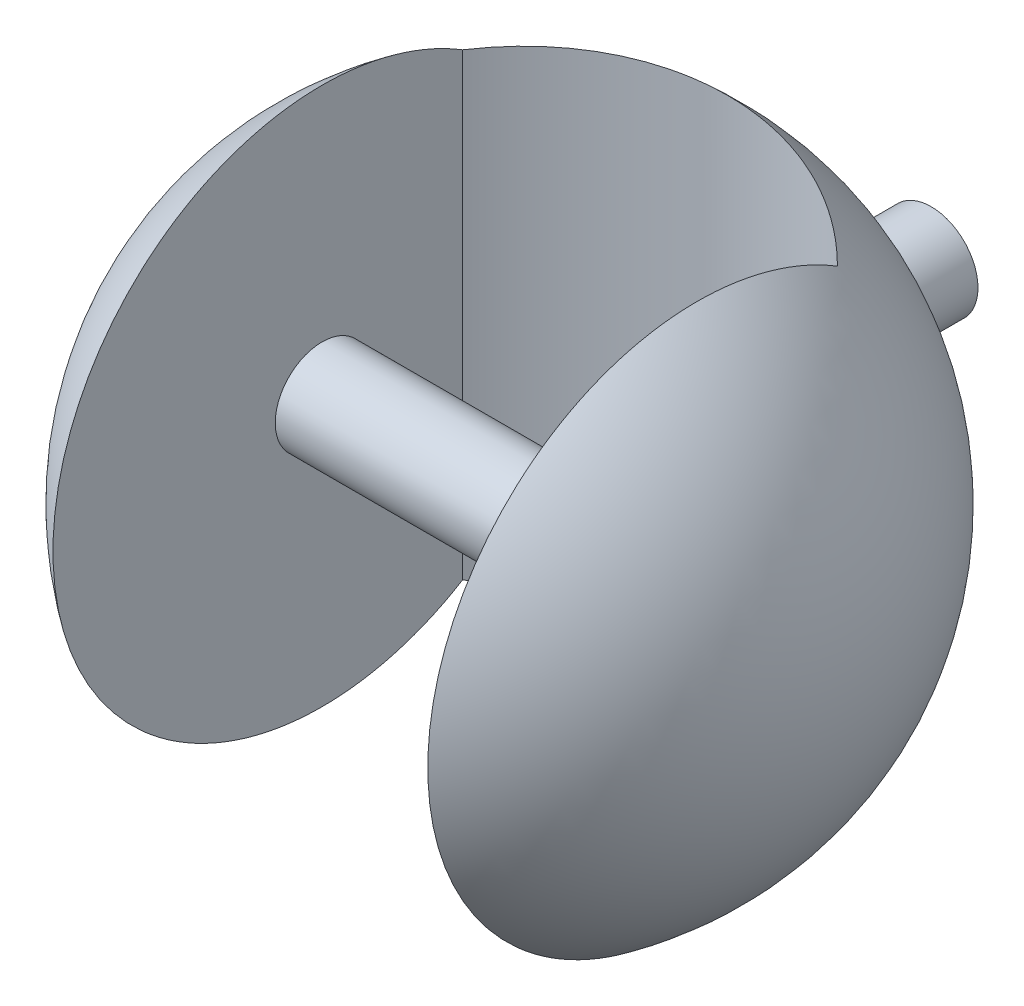
ISO-10303-21;
HEADER;
FILE_DESCRIPTION(('STEP AP214'),'2;1');
FILE_NAME('part.step','',(''),(''),'','','');
FILE_SCHEMA(('AUTOMOTIVE_DESIGN { 1 0 10303 214 1 1 1 1 }'));
ENDSEC;
DATA;
#1=APPLICATION_CONTEXT('core data for automotive mechanical design processes');
#2=APPLICATION_PROTOCOL_DEFINITION('international standard','automotive_design',2000,#1);
#3=PRODUCT_CONTEXT('',#1,'mechanical');
#4=PRODUCT('Part','Part','',(#3));
#5=PRODUCT_RELATED_PRODUCT_CATEGORY('part','',(#4));
#6=PRODUCT_DEFINITION_FORMATION('','',#4);
#7=PRODUCT_DEFINITION_CONTEXT('part definition',#1,'design');
#8=PRODUCT_DEFINITION('design','',#6,#7);
#9=PRODUCT_DEFINITION_SHAPE('','',#8);
#10=(LENGTH_UNIT() NAMED_UNIT(*) SI_UNIT(.MILLI.,.METRE.));
#11=(NAMED_UNIT(*) PLANE_ANGLE_UNIT() SI_UNIT($,.RADIAN.));
#12=(NAMED_UNIT(*) SI_UNIT($,.STERADIAN.) SOLID_ANGLE_UNIT());
#13=UNCERTAINTY_MEASURE_WITH_UNIT(LENGTH_MEASURE(1.E-05),#10,'distance_accuracy_value','');
#14=(GEOMETRIC_REPRESENTATION_CONTEXT(3) GLOBAL_UNCERTAINTY_ASSIGNED_CONTEXT((#13)) GLOBAL_UNIT_ASSIGNED_CONTEXT((#10,
#11,#12)) REPRESENTATION_CONTEXT('',''));
#15=CARTESIAN_POINT('',(0.,0.,0.));
#16=DIRECTION('',(0.,0.,1.));
#17=DIRECTION('',(1.,0.,0.));
#18=AXIS2_PLACEMENT_3D('',#15,#16,#17);
#19=CARTESIAN_POINT('',(0.,0.,0.));
#20=DIRECTION('',(0.,1.,0.));
#21=DIRECTION('',(-1.,0.,0.));
#22=AXIS2_PLACEMENT_3D('',#19,#20,#21);
#23=SPHERICAL_SURFACE('',#22,70.);
#24=CARTESIAN_POINT('',(0.,0.,-69.2820323027551));
#25=DIRECTION('',(0.,0.,1.));
#26=DIRECTION('',(1.,0.,0.));
#27=AXIS2_PLACEMENT_3D('',#24,#25,#26);
#28=CIRCLE('',#27,10.);
#29=CARTESIAN_POINT('',(10.,0.,-69.2820323027551));
#30=VERTEX_POINT('',#29);
#31=EDGE_CURVE('E116',#30,#30,#28,.T.);
#32=ORIENTED_EDGE('',*,*,#31,.T.);
#33=EDGE_LOOP('',(#32));
#34=FACE_BOUND('',#33,.T.);
#35=CARTESIAN_POINT('',(40.,0.,0.));
#36=DIRECTION('',(-1.,0.,0.));
#37=DIRECTION('',(0.,0.,1.));
#38=AXIS2_PLACEMENT_3D('',#35,#36,#37);
#39=CIRCLE('',#38,57.4456264653803);
#40=CARTESIAN_POINT('',(40.,-48.9897948556635,-30.));
#41=VERTEX_POINT('',#40);
#42=CARTESIAN_POINT('',(40.,48.9897948556635,-30.));
#43=VERTEX_POINT('',#42);
#44=EDGE_CURVE('E11',#41,#43,#39,.T.);
#45=ORIENTED_EDGE('',*,*,#44,.F.);
#46=CARTESIAN_POINT('',(40.0002,-48.9897540306134,-29.999799999));
#47=CARTESIAN_POINT('',(39.4466567527181,-49.1027490738307,-30.5533625324634));
#48=CARTESIAN_POINT('',(38.8813377858933,-49.2130612063612,-31.0956916598626));
#49=CARTESIAN_POINT('',(37.7280973534656,-49.4282271550248,-32.1569025797413));
#50=CARTESIAN_POINT('',(37.1401757110892,-49.5330809284533,-32.6757841887708));
#51=CARTESIAN_POINT('',(35.9426700616578,-49.7372388760222,-33.6891256633043));
#52=CARTESIAN_POINT('',(35.3330854220971,-49.8365428879052,-34.1835848147242));
#53=CARTESIAN_POINT('',(34.0933564664239,-50.0295020236911,-35.1470883423619));
#54=CARTESIAN_POINT('',(33.4632122270316,-50.1231571686696,-35.6161328133998));
#55=CARTESIAN_POINT('',(31.5439183936603,-50.3954613203584,-36.9834772623632));
#56=CARTESIAN_POINT('',(30.225236127298,-50.5655633352996,-37.8425566590063));
#57=CARTESIAN_POINT('',(27.518981264266,-50.8822247483092,-39.4487860071164));
#58=CARTESIAN_POINT('',(26.1314110242356,-51.0287849510113,-40.1959397840211));
#59=CARTESIAN_POINT('',(23.2955725476409,-51.2979888391331,-41.5732760729456));
#60=CARTESIAN_POINT('',(21.8472524506671,-51.420611563365,-42.2033560446009));
#61=CARTESIAN_POINT('',(18.9013402366622,-51.6413265166273,-43.340720975418));
#62=CARTESIAN_POINT('',(17.4037472422985,-51.7394183086026,-43.8480037467589));
#63=CARTESIAN_POINT('',(14.3705357256728,-51.9106825209439,-44.7355813026548));
#64=CARTESIAN_POINT('',(12.8349300655307,-51.9838632499525,-45.1159184268492));
#65=CARTESIAN_POINT('',(9.7363200852312,-52.1050798467018,-45.7467834463807));
#66=CARTESIAN_POINT('',(8.1733161463533,-52.1531160640714,-45.9973131466617));
#67=CARTESIAN_POINT('',(5.04505706416756,-52.2235572149978,-46.364934970711));
#68=CARTESIAN_POINT('',(3.47994226401731,-52.2461835617224,-46.4831797462499));
#69=CARTESIAN_POINT('',(0.345134863591997,-52.2664769260572,-46.5892253089531));
#70=CARTESIAN_POINT('',(-1.2245577330356,-52.264143963549,-46.5770262000231));
#71=CARTESIAN_POINT('',(-4.35748291286424,-52.2345250578485,-46.422269471584));
#72=CARTESIAN_POINT('',(-5.92071456958772,-52.2072356527223,-46.2796937663581));
#73=CARTESIAN_POINT('',(-9.02928949492544,-52.127798490742,-45.8652899755459));
#74=CARTESIAN_POINT('',(-10.5746330026919,-52.0756510666165,-45.5934636200005));
#75=CARTESIAN_POINT('',(-13.6307794409066,-51.9469254410824,-44.9239469604016));
#76=CARTESIAN_POINT('',(-15.1416886963919,-51.8704380047706,-44.5267243085108));
#77=CARTESIAN_POINT('',(-18.1242771996816,-51.693245248889,-43.6091879177184));
#78=CARTESIAN_POINT('',(-19.595954681955,-51.5925388414401,-43.0888686495217));
#79=CARTESIAN_POINT('',(-22.4893556012906,-51.3673019902125,-41.9293519523771));
#80=CARTESIAN_POINT('',(-23.9110912623345,-51.2427774250481,-41.2901838578632));
#81=CARTESIAN_POINT('',(-26.695049699917,-50.9703401964458,-39.8978514881855));
#82=CARTESIAN_POINT('',(-28.0572834542506,-50.822431870651,-39.1447083562804));
#83=CARTESIAN_POINT('',(-30.3516824481366,-50.5471266729628,-37.7499292541622));
#84=CARTESIAN_POINT('',(-31.3000454516843,-50.4250930281648,-37.13368135546));
#85=CARTESIAN_POINT('',(-33.1569733881774,-50.1691545735308,-35.8463849081769));
#86=CARTESIAN_POINT('',(-34.0655452047344,-50.0352518291869,-35.175345896087));
#87=CARTESIAN_POINT('',(-35.8385797463869,-49.756003895915,-33.7820220837714));
#88=CARTESIAN_POINT('',(-36.7031015198347,-49.6106747264706,-33.0598091633601));
#89=CARTESIAN_POINT('',(-38.386590849925,-49.308660358803,-31.5660621779035));
#90=CARTESIAN_POINT('',(-39.205551151513,-49.1519733610938,-30.7945202996827));
#91=CARTESIAN_POINT('',(-40.0002,-48.9897540306134,-29.999799999));
#92=B_SPLINE_CURVE_WITH_KNOTS('',3,(#46,#47,#48,#49,#50,#51,#52,#53,#54,#55,#56,#57,#58,#59,#60,
#61,#62,#63,#64,#65,#66,#67,#68,#69,#70,#71,#72,#73,#74,#75,#76,#77,#78,#79,#80,#81,#82,#83,#84,
#85,#86,#87,#88,#89,#90,#91),.UNSPECIFIED.,.F.,.F.,(4,2,2,2,2,2,2,2,2,2,2,2,2,2,2,2,2,2,2,2,2,2,
4),(0.,2.37268353764716,4.74538563561067,7.11815706758324,9.49091964632913,14.2337916190203,
18.9765014509745,23.7233458551625,28.4702748254604,33.2156189870585,37.9608971639074,
42.6644977217678,47.3680945329573,52.0723439215946,56.7765303448635,61.4633762373442,
66.1504326951299,70.8363338190074,75.5213667348299,78.932110320965,82.3422615213888,
85.7477142468276,89.1537077019809),.UNSPECIFIED.);
#93=CARTESIAN_POINT('',(-40.,-48.9897948556636,-30.));
#94=VERTEX_POINT('',#93);
#95=EDGE_CURVE('E61',#41,#94,#92,.T.);
#96=ORIENTED_EDGE('',*,*,#95,.T.);
#97=CARTESIAN_POINT('',(-40.,0.,0.));
#98=DIRECTION('',(1.,0.,0.));
#99=DIRECTION('',(0.,0.,-1.));
#100=AXIS2_PLACEMENT_3D('',#97,#98,#99);
#101=CIRCLE('',#100,57.4456264653803);
#102=CARTESIAN_POINT('',(-40.,48.9897948556636,-30.));
#103=VERTEX_POINT('',#102);
#104=EDGE_CURVE('E45',#103,#94,#101,.T.);
#105=ORIENTED_EDGE('',*,*,#104,.F.);
#106=CARTESIAN_POINT('',(-40.0002,48.9897540306134,-29.999799999));
#107=CARTESIAN_POINT('',(-39.4466567527181,49.1027490738307,-30.5533625324634));
#108=CARTESIAN_POINT('',(-38.8813377858933,49.2130612063612,-31.0956916598626));
#109=CARTESIAN_POINT('',(-37.7280973534656,49.4282271550248,-32.1569025797413));
#110=CARTESIAN_POINT('',(-37.1401757110892,49.5330809284533,-32.6757841887708));
#111=CARTESIAN_POINT('',(-35.9426700616578,49.7372388760222,-33.6891256633043));
#112=CARTESIAN_POINT('',(-35.3330854220971,49.8365428879052,-34.1835848147242));
#113=CARTESIAN_POINT('',(-34.0933564664239,50.0295020236911,-35.1470883423619));
#114=CARTESIAN_POINT('',(-33.4632122270316,50.1231571686696,-35.6161328133998));
#115=CARTESIAN_POINT('',(-31.5439183936603,50.3954613203584,-36.9834772623632));
#116=CARTESIAN_POINT('',(-30.225236127298,50.5655633352996,-37.8425566590063));
#117=CARTESIAN_POINT('',(-27.518981264266,50.8822247483092,-39.4487860071164));
#118=CARTESIAN_POINT('',(-26.1314110242356,51.0287849510113,-40.1959397840211));
#119=CARTESIAN_POINT('',(-23.2955725476409,51.2979888391331,-41.5732760729456));
#120=CARTESIAN_POINT('',(-21.8472524506671,51.420611563365,-42.2033560446009));
#121=CARTESIAN_POINT('',(-18.9013402366622,51.6413265166273,-43.340720975418));
#122=CARTESIAN_POINT('',(-17.4037472422985,51.7394183086026,-43.8480037467589));
#123=CARTESIAN_POINT('',(-14.3705357256728,51.9106825209439,-44.7355813026548));
#124=CARTESIAN_POINT('',(-12.8349300655307,51.9838632499525,-45.1159184268492));
#125=CARTESIAN_POINT('',(-9.7363200852312,52.1050798467018,-45.7467834463807));
#126=CARTESIAN_POINT('',(-8.1733161463533,52.1531160640714,-45.9973131466617));
#127=CARTESIAN_POINT('',(-5.04505706416756,52.2235572149978,-46.364934970711));
#128=CARTESIAN_POINT('',(-3.47994226401731,52.2461835617224,-46.4831797462499));
#129=CARTESIAN_POINT('',(-0.345134863591997,52.2664769260572,-46.5892253089531));
#130=CARTESIAN_POINT('',(1.2245577330356,52.264143963549,-46.5770262000231));
#131=CARTESIAN_POINT('',(4.35748291286424,52.2345250578485,-46.422269471584));
#132=CARTESIAN_POINT('',(5.92071456958772,52.2072356527223,-46.2796937663581));
#133=CARTESIAN_POINT('',(9.02928949492544,52.127798490742,-45.8652899755459));
#134=CARTESIAN_POINT('',(10.5746330026919,52.0756510666165,-45.5934636200005));
#135=CARTESIAN_POINT('',(13.6307794409066,51.9469254410824,-44.9239469604016));
#136=CARTESIAN_POINT('',(15.1416886963919,51.8704380047706,-44.5267243085108));
#137=CARTESIAN_POINT('',(18.1242771996816,51.693245248889,-43.6091879177184));
#138=CARTESIAN_POINT('',(19.595954681955,51.5925388414401,-43.0888686495217));
#139=CARTESIAN_POINT('',(22.4893556012906,51.3673019902125,-41.9293519523771));
#140=CARTESIAN_POINT('',(23.9110912623345,51.2427774250481,-41.2901838578632));
#141=CARTESIAN_POINT('',(26.695049699917,50.9703401964458,-39.8978514881855));
#142=CARTESIAN_POINT('',(28.0572834542506,50.822431870651,-39.1447083562804));
#143=CARTESIAN_POINT('',(30.3516824481366,50.5471266729628,-37.7499292541622));
#144=CARTESIAN_POINT('',(31.3000454516843,50.4250930281648,-37.13368135546));
#145=CARTESIAN_POINT('',(33.1569733881774,50.1691545735308,-35.8463849081769));
#146=CARTESIAN_POINT('',(34.0655452047344,50.0352518291869,-35.175345896087));
#147=CARTESIAN_POINT('',(35.8385797463869,49.756003895915,-33.7820220837714));
#148=CARTESIAN_POINT('',(36.7031015198347,49.6106747264706,-33.0598091633601));
#149=CARTESIAN_POINT('',(38.386590849925,49.308660358803,-31.5660621779035));
#150=CARTESIAN_POINT('',(39.205551151513,49.1519733610938,-30.7945202996827));
#151=CARTESIAN_POINT('',(40.0002,48.9897540306134,-29.999799999));
#152=B_SPLINE_CURVE_WITH_KNOTS('',3,(#106,#107,#108,#109,#110,#111,#112,#113,#114,#115,#116,
#117,#118,#119,#120,#121,#122,#123,#124,#125,#126,#127,#128,#129,#130,#131,#132,#133,#134,#135,
#136,#137,#138,#139,#140,#141,#142,#143,#144,#145,#146,#147,#148,#149,#150,#151),.UNSPECIFIED.,
.F.,.F.,(4,2,2,2,2,2,2,2,2,2,2,2,2,2,2,2,2,2,2,2,2,2,4),(0.,2.37268353764716,4.74538563561067,
7.11815706758324,9.49091964632913,14.2337916190203,18.9765014509745,23.7233458551625,
28.4702748254604,33.2156189870585,37.9608971639074,42.6644977217678,47.3680945329573,
52.0723439215946,56.7765303448635,61.4633762373442,66.1504326951299,70.8363338190074,
75.5213667348299,78.932110320965,82.3422615213888,85.7477142468276,89.1537077019809),.UNSPECIFIED.);
#153=EDGE_CURVE('E52',#103,#43,#152,.T.);
#154=ORIENTED_EDGE('',*,*,#153,.T.);
#155=EDGE_LOOP('',(#45,#96,#105,#154));
#156=FACE_BOUND('',#155,.T.);
#157=ADVANCED_FACE('F37',(#34,#156),#23,.T.);
#158=CARTESIAN_POINT('',(40.,200.,70.));
#159=DIRECTION('',(-1.,0.,0.));
#160=DIRECTION('',(0.,0.,1.));
#161=AXIS2_PLACEMENT_3D('',#158,#159,#160);
#162=PLANE('',#161);
#163=CARTESIAN_POINT('',(40.,0.,0.));
#164=DIRECTION('',(-1.,0.,0.));
#165=DIRECTION('',(0.,0.,1.));
#166=AXIS2_PLACEMENT_3D('',#163,#164,#165);
#167=CIRCLE('',#166,10.);
#168=CARTESIAN_POINT('',(40.,0.,10.));
#169=VERTEX_POINT('',#168);
#170=EDGE_CURVE('E112',#169,#169,#167,.T.);
#171=ORIENTED_EDGE('',*,*,#170,.F.);
#172=EDGE_LOOP('',(#171));
#173=FACE_BOUND('',#172,.T.);
#174=ORIENTED_EDGE('',*,*,#44,.T.);
#175=DIRECTION('',(0.,-1.,0.));
#176=VECTOR('',#175,1.);
#177=CARTESIAN_POINT('',(40.,200.,-30.));
#178=LINE('',#177,#176);
#179=EDGE_CURVE('E64',#43,#41,#178,.T.);
#180=ORIENTED_EDGE('',*,*,#179,.T.);
#181=EDGE_LOOP('',(#174,#180));
#182=FACE_BOUND('',#181,.T.);
#183=ADVANCED_FACE('F72',(#173,#182),#162,.T.);
#184=CARTESIAN_POINT('',(-40.,200.,70.));
#185=DIRECTION('',(1.,0.,0.));
#186=DIRECTION('',(0.,0.,-1.));
#187=AXIS2_PLACEMENT_3D('',#184,#185,#186);
#188=PLANE('',#187);
#189=CARTESIAN_POINT('',(-40.,0.,0.));
#190=DIRECTION('',(1.,0.,0.));
#191=DIRECTION('',(0.,0.,-1.));
#192=AXIS2_PLACEMENT_3D('',#189,#190,#191);
#193=CIRCLE('',#192,10.);
#194=CARTESIAN_POINT('',(-40.,0.,-10.));
#195=VERTEX_POINT('',#194);
#196=EDGE_CURVE('E69',#195,#195,#193,.T.);
#197=ORIENTED_EDGE('',*,*,#196,.F.);
#198=EDGE_LOOP('',(#197));
#199=FACE_BOUND('',#198,.T.);
#200=ORIENTED_EDGE('',*,*,#104,.T.);
#201=DIRECTION('',(0.,-1.,0.));
#202=VECTOR('',#201,1.);
#203=CARTESIAN_POINT('',(-40.,200.,-30.));
#204=LINE('',#203,#202);
#205=EDGE_CURVE('E56',#103,#94,#204,.T.);
#206=ORIENTED_EDGE('',*,*,#205,.F.);
#207=EDGE_LOOP('',(#200,#206));
#208=FACE_BOUND('',#207,.T.);
#209=ADVANCED_FACE('F100',(#199,#208),#188,.T.);
#210=CARTESIAN_POINT('',(0.,0.,-90.));
#211=DIRECTION('',(0.,0.,1.));
#212=DIRECTION('',(1.,0.,0.));
#213=AXIS2_PLACEMENT_3D('',#210,#211,#212);
#214=CYLINDRICAL_SURFACE('',#213,10.);
#215=CARTESIAN_POINT('',(0.,0.,-90.));
#216=DIRECTION('',(0.,0.,1.));
#217=DIRECTION('',(1.,0.,0.));
#218=AXIS2_PLACEMENT_3D('',#215,#216,#217);
#219=CIRCLE('',#218,10.);
#220=CARTESIAN_POINT('',(10.,0.,-90.));
#221=VERTEX_POINT('',#220);
#222=EDGE_CURVE('E113',#221,#221,#219,.T.);
#223=ORIENTED_EDGE('',*,*,#222,.T.);
#224=EDGE_LOOP('',(#223));
#225=FACE_BOUND('',#224,.T.);
#226=ORIENTED_EDGE('',*,*,#31,.F.);
#227=EDGE_LOOP('',(#226));
#228=FACE_BOUND('',#227,.T.);
#229=ADVANCED_FACE('F96',(#225,#228),#214,.T.);
#230=CARTESIAN_POINT('',(0.,0.,-90.));
#231=DIRECTION('',(0.,0.,1.));
#232=DIRECTION('',(1.,0.,0.));
#233=AXIS2_PLACEMENT_3D('',#230,#231,#232);
#234=PLANE('',#233);
#235=ORIENTED_EDGE('',*,*,#222,.F.);
#236=EDGE_LOOP('',(#235));
#237=FACE_BOUND('',#236,.T.);
#238=ADVANCED_FACE('F92',(#237),#234,.F.);
#239=CARTESIAN_POINT('',(68.2842712474619,0.,0.));
#240=DIRECTION('',(-1.,0.,0.));
#241=DIRECTION('',(0.,0.,1.));
#242=AXIS2_PLACEMENT_3D('',#239,#240,#241);
#243=CYLINDRICAL_SURFACE('',#242,10.);
#244=ORIENTED_EDGE('',*,*,#170,.T.);
#245=EDGE_LOOP('',(#244));
#246=FACE_BOUND('',#245,.T.);
#247=ORIENTED_EDGE('',*,*,#196,.T.);
#248=EDGE_LOOP('',(#247));
#249=FACE_BOUND('',#248,.T.);
#250=ADVANCED_FACE('F88',(#246,#249),#243,.T.);
#251=CARTESIAN_POINT('',(0.,-63.2455532033676,9.99999999999999));
#252=DIRECTION('',(0.,1.,0.));
#253=DIRECTION('',(0.,0.,1.));
#254=AXIS2_PLACEMENT_3D('',#251,#252,#253);
#255=CYLINDRICAL_SURFACE('',#254,56.5685424949238);
#256=ORIENTED_EDGE('',*,*,#179,.F.);
#257=ORIENTED_EDGE('',*,*,#153,.F.);
#258=ORIENTED_EDGE('',*,*,#205,.T.);
#259=ORIENTED_EDGE('',*,*,#95,.F.);
#260=EDGE_LOOP('',(#256,#257,#258,#259));
#261=FACE_BOUND('',#260,.T.);
#262=ADVANCED_FACE('F63',(#261),#255,.F.);
#263=CLOSED_SHELL('',(#157,#183,#209,#229,#238,#250,#262));
#264=MANIFOLD_SOLID_BREP('B2',#263);
#265=ADVANCED_BREP_SHAPE_REPRESENTATION('',(#18,#264),#14);
#266=SHAPE_DEFINITION_REPRESENTATION(#9,#265);
ENDSEC;
END-ISO-10303-21;
